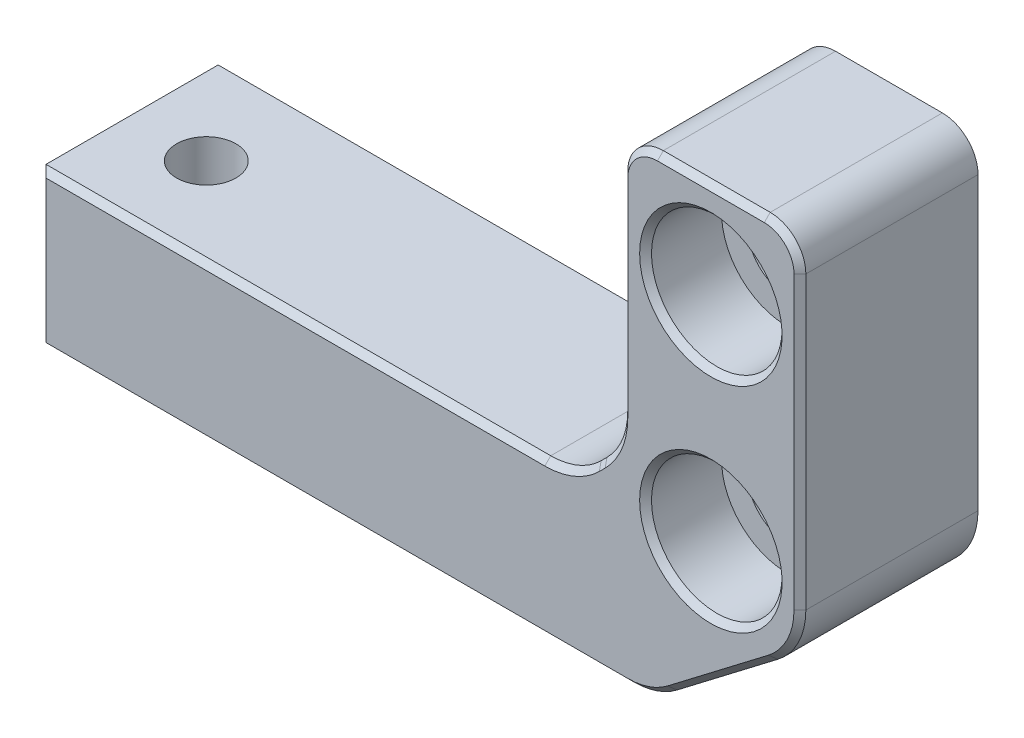
ISO-10303-21;
HEADER;
FILE_DESCRIPTION(('STEP AP214'),'2;1');
FILE_NAME('part.step','',(''),(''),'','','');
FILE_SCHEMA(('AUTOMOTIVE_DESIGN { 1 0 10303 214 1 1 1 1 }'));
ENDSEC;
DATA;
#1=APPLICATION_CONTEXT('core data for automotive mechanical design processes');
#2=APPLICATION_PROTOCOL_DEFINITION('international standard','automotive_design',2000,#1);
#3=PRODUCT_CONTEXT('',#1,'mechanical');
#4=PRODUCT('Part','Part','',(#3));
#5=PRODUCT_RELATED_PRODUCT_CATEGORY('part','',(#4));
#6=PRODUCT_DEFINITION_FORMATION('','',#4);
#7=PRODUCT_DEFINITION_CONTEXT('part definition',#1,'design');
#8=PRODUCT_DEFINITION('design','',#6,#7);
#9=PRODUCT_DEFINITION_SHAPE('','',#8);
#10=(LENGTH_UNIT() NAMED_UNIT(*) SI_UNIT(.MILLI.,.METRE.));
#11=(NAMED_UNIT(*) PLANE_ANGLE_UNIT() SI_UNIT($,.RADIAN.));
#12=(NAMED_UNIT(*) SI_UNIT($,.STERADIAN.) SOLID_ANGLE_UNIT());
#13=UNCERTAINTY_MEASURE_WITH_UNIT(LENGTH_MEASURE(1.E-05),#10,'distance_accuracy_value','');
#14=(GEOMETRIC_REPRESENTATION_CONTEXT(3) GLOBAL_UNCERTAINTY_ASSIGNED_CONTEXT((#13)) GLOBAL_UNIT_ASSIGNED_CONTEXT((#10,
#11,#12)) REPRESENTATION_CONTEXT('',''));
#15=CARTESIAN_POINT('',(0.,0.,0.));
#16=DIRECTION('',(0.,0.,1.));
#17=DIRECTION('',(1.,0.,0.));
#18=AXIS2_PLACEMENT_3D('',#15,#16,#17);
#19=CARTESIAN_POINT('',(19.014718625759,-13.832454105557,0.));
#20=DIRECTION('',(0.,0.,-1.));
#21=DIRECTION('',(-1.,0.,0.));
#22=AXIS2_PLACEMENT_3D('',#19,#20,#21);
#23=PLANE('',#22);
#24=DIRECTION('',(0.,-1.,0.));
#25=VECTOR('',#24,1.);
#26=CARTESIAN_POINT('',(-30.4999999999976,-6.83245410555701,0.));
#27=LINE('',#26,#25);
#28=CARTESIAN_POINT('',(-30.4999999999976,-6.83245410555701,0.));
#29=VERTEX_POINT('',#28);
#30=CARTESIAN_POINT('',(-30.4999999999976,-19.832454105557,0.));
#31=VERTEX_POINT('',#30);
#32=EDGE_CURVE('E191',#29,#31,#27,.T.);
#33=ORIENTED_EDGE('',*,*,#32,.F.);
#34=DIRECTION('',(-1.,0.,0.));
#35=VECTOR('',#34,1.);
#36=CARTESIAN_POINT('',(-30.4999999999976,-6.83245410555701,0.));
#37=LINE('',#36,#35);
#38=CARTESIAN_POINT('',(12.014718625759,-6.83245410555701,0.));
#39=VERTEX_POINT('',#38);
#40=EDGE_CURVE('E237',#39,#29,#37,.T.);
#41=ORIENTED_EDGE('',*,*,#40,.F.);
#42=CARTESIAN_POINT('',(12.014718625759,-0.832454105557007,0.));
#43=DIRECTION('',(0.,0.,-1.));
#44=DIRECTION('',(-1.,0.,0.));
#45=AXIS2_PLACEMENT_3D('',#42,#43,#44);
#46=CIRCLE('',#45,6.);
#47=CARTESIAN_POINT('',(16.2573593128783,-5.07509479267625,0.));
#48=VERTEX_POINT('',#47);
#49=EDGE_CURVE('E234',#48,#39,#46,.T.);
#50=ORIENTED_EDGE('',*,*,#49,.F.);
#51=DIRECTION('',(-0.707106781186538,-0.707106781186557,0.));
#52=VECTOR('',#51,1.);
#53=CARTESIAN_POINT('',(16.2573593128783,-5.07509479267625,0.));
#54=LINE('',#53,#52);
#55=CARTESIAN_POINT('',(16.7426406871169,-4.58981341843767,0.));
#56=VERTEX_POINT('',#55);
#57=EDGE_CURVE('E231',#56,#48,#54,.T.);
#58=ORIENTED_EDGE('',*,*,#57,.F.);
#59=CARTESIAN_POINT('',(12.4999999999976,-0.347172731318424,0.));
#60=DIRECTION('',(0.,0.,-1.));
#61=DIRECTION('',(1.,0.,0.));
#62=AXIS2_PLACEMENT_3D('',#59,#60,#61);
#63=CIRCLE('',#62,6.);
#64=CARTESIAN_POINT('',(18.4999999999976,-0.347172731318424,0.));
#65=VERTEX_POINT('',#64);
#66=EDGE_CURVE('E228',#65,#56,#63,.T.);
#67=ORIENTED_EDGE('',*,*,#66,.F.);
#68=DIRECTION('',(0.,-1.,0.));
#69=VECTOR('',#68,1.);
#70=CARTESIAN_POINT('',(18.4999999999976,-0.347172731318424,0.));
#71=LINE('',#70,#69);
#72=CARTESIAN_POINT('',(18.4999999999976,17.167545894443,0.));
#73=VERTEX_POINT('',#72);
#74=EDGE_CURVE('E225',#73,#65,#71,.T.);
#75=ORIENTED_EDGE('',*,*,#74,.F.);
#76=CARTESIAN_POINT('',(21.4999999999976,17.167545894443,0.));
#77=DIRECTION('',(0.,0.,1.));
#78=DIRECTION('',(1.,0.,0.));
#79=AXIS2_PLACEMENT_3D('',#76,#77,#78);
#80=CIRCLE('',#79,3.);
#81=CARTESIAN_POINT('',(21.4999999999976,20.167545894443,0.));
#82=VERTEX_POINT('',#81);
#83=EDGE_CURVE('E222',#82,#73,#80,.T.);
#84=ORIENTED_EDGE('',*,*,#83,.F.);
#85=DIRECTION('',(-1.,0.,0.));
#86=VECTOR('',#85,1.);
#87=CARTESIAN_POINT('',(30.4999999999976,20.167545894443,0.));
#88=LINE('',#87,#86);
#89=CARTESIAN_POINT('',(30.4999999999976,20.167545894443,0.));
#90=VERTEX_POINT('',#89);
#91=EDGE_CURVE('E219',#90,#82,#88,.T.);
#92=ORIENTED_EDGE('',*,*,#91,.F.);
#93=CARTESIAN_POINT('',(30.4999999999976,17.167545894443,0.));
#94=DIRECTION('',(0.,0.,1.));
#95=DIRECTION('',(1.,0.,0.));
#96=AXIS2_PLACEMENT_3D('',#93,#94,#95);
#97=CIRCLE('',#96,3.);
#98=CARTESIAN_POINT('',(33.4999999999976,17.167545894443,0.));
#99=VERTEX_POINT('',#98);
#100=EDGE_CURVE('E216',#99,#90,#97,.T.);
#101=ORIENTED_EDGE('',*,*,#100,.F.);
#102=DIRECTION('',(0.,1.,0.));
#103=VECTOR('',#102,1.);
#104=CARTESIAN_POINT('',(33.4999999999976,-7.34717273131841,0.));
#105=LINE('',#104,#103);
#106=CARTESIAN_POINT('',(33.4999999999976,-7.34717273131841,0.));
#107=VERTEX_POINT('',#106);
#108=EDGE_CURVE('E213',#107,#99,#105,.T.);
#109=ORIENTED_EDGE('',*,*,#108,.F.);
#110=CARTESIAN_POINT('',(27.4999999999976,-7.34717273131841,0.));
#111=DIRECTION('',(0.,0.,1.));
#112=DIRECTION('',(1.,0.,0.));
#113=AXIS2_PLACEMENT_3D('',#110,#111,#112);
#114=CIRCLE('',#113,6.);
#115=CARTESIAN_POINT('',(31.1434728099418,-12.1142584116054,0.));
#116=VERTEX_POINT('',#115);
#117=EDGE_CURVE('E210',#116,#107,#114,.T.);
#118=ORIENTED_EDGE('',*,*,#117,.F.);
#119=DIRECTION('',(0.794514280047827,0.60724546832404,0.));
#120=VECTOR('',#119,1.);
#121=CARTESIAN_POINT('',(22.6581914357032,-18.599539785844,0.));
#122=LINE('',#121,#120);
#123=CARTESIAN_POINT('',(22.6581914357032,-18.599539785844,0.));
#124=VERTEX_POINT('',#123);
#125=EDGE_CURVE('E207',#124,#116,#122,.T.);
#126=ORIENTED_EDGE('',*,*,#125,.F.);
#127=CARTESIAN_POINT('',(19.014718625759,-13.832454105557,0.));
#128=DIRECTION('',(0.,0.,1.));
#129=DIRECTION('',(-1.,0.,0.));
#130=AXIS2_PLACEMENT_3D('',#127,#128,#129);
#131=CIRCLE('',#130,6.00000000000001);
#132=CARTESIAN_POINT('',(19.014718625759,-19.832454105557,0.));
#133=VERTEX_POINT('',#132);
#134=EDGE_CURVE('E194',#133,#124,#131,.T.);
#135=ORIENTED_EDGE('',*,*,#134,.F.);
#136=DIRECTION('',(1.,0.,0.));
#137=VECTOR('',#136,1.);
#138=CARTESIAN_POINT('',(-30.4999999999976,-19.832454105557,0.));
#139=LINE('',#138,#137);
#140=EDGE_CURVE('E179',#31,#133,#139,.T.);
#141=ORIENTED_EDGE('',*,*,#140,.F.);
#142=EDGE_LOOP('',(#33,#41,#50,#58,#67,#75,#84,#92,#101,#109,#118,#126,#135,#141));
#143=FACE_BOUND('',#142,.T.);
#144=CARTESIAN_POINT('',(25.9999999999976,-5.83245410555701,0.));
#145=DIRECTION('',(0.,0.,1.));
#146=DIRECTION('',(1.,0.,0.));
#147=AXIS2_PLACEMENT_3D('',#144,#145,#146);
#148=CIRCLE('',#147,3.3);
#149=CARTESIAN_POINT('',(29.2999999999976,-5.83245410555701,0.));
#150=VERTEX_POINT('',#149);
#151=EDGE_CURVE('E199',#150,#150,#148,.T.);
#152=ORIENTED_EDGE('',*,*,#151,.T.);
#153=EDGE_LOOP('',(#152));
#154=FACE_BOUND('',#153,.T.);
#155=CARTESIAN_POINT('',(25.9999999999976,12.167545894443,0.));
#156=DIRECTION('',(0.,0.,1.));
#157=DIRECTION('',(1.,0.,0.));
#158=AXIS2_PLACEMENT_3D('',#155,#156,#157);
#159=CIRCLE('',#158,3.3);
#160=CARTESIAN_POINT('',(29.2999999999976,12.167545894443,0.));
#161=VERTEX_POINT('',#160);
#162=EDGE_CURVE('E386',#161,#161,#159,.T.);
#163=ORIENTED_EDGE('',*,*,#162,.T.);
#164=EDGE_LOOP('',(#163));
#165=FACE_BOUND('',#164,.T.);
#166=ADVANCED_FACE('F32',(#143,#154,#165),#23,.T.);
#167=CARTESIAN_POINT('',(19.014718625759,-13.832454105557,15.));
#168=DIRECTION('',(0.,0.,-1.));
#169=DIRECTION('',(-1.,0.,0.));
#170=AXIS2_PLACEMENT_3D('',#167,#168,#169);
#171=PLANE('',#170);
#172=CARTESIAN_POINT('',(25.9999999999976,12.167545894443,15.));
#173=DIRECTION('',(0.,0.,-1.));
#174=DIRECTION('',(-1.,0.,0.));
#175=AXIS2_PLACEMENT_3D('',#172,#173,#174);
#176=CIRCLE('',#175,6.);
#177=CARTESIAN_POINT('',(19.9999999999976,12.167545894443,15.));
#178=VERTEX_POINT('',#177);
#179=EDGE_CURVE('E297',#178,#178,#176,.T.);
#180=ORIENTED_EDGE('',*,*,#179,.T.);
#181=EDGE_LOOP('',(#180));
#182=FACE_BOUND('',#181,.T.);
#183=CARTESIAN_POINT('',(25.9999999999976,-5.83245410555701,15.));
#184=DIRECTION('',(0.,0.,-1.));
#185=DIRECTION('',(-1.,0.,0.));
#186=AXIS2_PLACEMENT_3D('',#183,#184,#185);
#187=CIRCLE('',#186,5.99999999999999);
#188=CARTESIAN_POINT('',(19.9999999999976,-5.83245410555701,15.));
#189=VERTEX_POINT('',#188);
#190=EDGE_CURVE('E294',#189,#189,#187,.T.);
#191=ORIENTED_EDGE('',*,*,#190,.T.);
#192=EDGE_LOOP('',(#191));
#193=FACE_BOUND('',#192,.T.);
#194=DIRECTION('',(0.,-1.,0.));
#195=VECTOR('',#194,1.);
#196=CARTESIAN_POINT('',(-29.9999999999976,-13.832454105557,15.));
#197=LINE('',#196,#195);
#198=CARTESIAN_POINT('',(-29.9999999999976,-7.33245410555701,15.));
#199=VERTEX_POINT('',#198);
#200=CARTESIAN_POINT('',(-29.9999999999976,-19.332454105557,15.));
#201=VERTEX_POINT('',#200);
#202=EDGE_CURVE('E267',#199,#201,#197,.T.);
#203=ORIENTED_EDGE('',*,*,#202,.T.);
#204=DIRECTION('',(1.,0.,0.));
#205=VECTOR('',#204,1.);
#206=CARTESIAN_POINT('',(19.014718625759,-19.332454105557,15.));
#207=LINE('',#206,#205);
#208=CARTESIAN_POINT('',(19.014718625759,-19.332454105557,15.));
#209=VERTEX_POINT('',#208);
#210=EDGE_CURVE('E291',#201,#209,#207,.T.);
#211=ORIENTED_EDGE('',*,*,#210,.T.);
#212=CARTESIAN_POINT('',(19.014718625759,-13.832454105557,15.));
#213=DIRECTION('',(0.,0.,-1.));
#214=DIRECTION('',(-1.,0.,0.));
#215=AXIS2_PLACEMENT_3D('',#212,#213,#214);
#216=CIRCLE('',#215,5.50000000000001);
#217=CARTESIAN_POINT('',(22.3545687015412,-18.2022826458201,15.));
#218=VERTEX_POINT('',#217);
#219=EDGE_CURVE('E289',#209,#218,#216,.F.);
#220=ORIENTED_EDGE('',*,*,#219,.T.);
#221=DIRECTION('',(0.794514280047827,0.60724546832404,0.));
#222=VECTOR('',#221,1.);
#223=CARTESIAN_POINT('',(22.3545687015412,-18.2022826458201,15.));
#224=LINE('',#223,#222);
#225=CARTESIAN_POINT('',(30.8398500757798,-11.7170012715815,15.));
#226=VERTEX_POINT('',#225);
#227=EDGE_CURVE('E287',#218,#226,#224,.T.);
#228=ORIENTED_EDGE('',*,*,#227,.T.);
#229=CARTESIAN_POINT('',(27.4999999999976,-7.34717273131841,15.));
#230=DIRECTION('',(0.,0.,-1.));
#231=DIRECTION('',(-1.,0.,0.));
#232=AXIS2_PLACEMENT_3D('',#229,#230,#231);
#233=CIRCLE('',#232,5.5);
#234=CARTESIAN_POINT('',(32.9999999999976,-7.34717273131841,15.));
#235=VERTEX_POINT('',#234);
#236=EDGE_CURVE('E285',#226,#235,#233,.F.);
#237=ORIENTED_EDGE('',*,*,#236,.T.);
#238=DIRECTION('',(0.,1.,0.));
#239=VECTOR('',#238,1.);
#240=CARTESIAN_POINT('',(32.9999999999976,-13.832454105557,15.));
#241=LINE('',#240,#239);
#242=CARTESIAN_POINT('',(32.9999999999976,17.167545894443,15.));
#243=VERTEX_POINT('',#242);
#244=EDGE_CURVE('E283',#235,#243,#241,.T.);
#245=ORIENTED_EDGE('',*,*,#244,.T.);
#246=CARTESIAN_POINT('',(30.4999999999976,17.167545894443,15.));
#247=DIRECTION('',(0.,0.,-1.));
#248=DIRECTION('',(-1.,0.,0.));
#249=AXIS2_PLACEMENT_3D('',#246,#247,#248);
#250=CIRCLE('',#249,2.5);
#251=CARTESIAN_POINT('',(30.4999999999976,19.667545894443,15.));
#252=VERTEX_POINT('',#251);
#253=EDGE_CURVE('E281',#243,#252,#250,.F.);
#254=ORIENTED_EDGE('',*,*,#253,.T.);
#255=DIRECTION('',(-1.,0.,0.));
#256=VECTOR('',#255,1.);
#257=CARTESIAN_POINT('',(19.014718625759,19.667545894443,15.));
#258=LINE('',#257,#256);
#259=CARTESIAN_POINT('',(21.4999999999976,19.667545894443,15.));
#260=VERTEX_POINT('',#259);
#261=EDGE_CURVE('E279',#252,#260,#258,.T.);
#262=ORIENTED_EDGE('',*,*,#261,.T.);
#263=CARTESIAN_POINT('',(21.4999999999976,17.167545894443,15.));
#264=DIRECTION('',(0.,0.,-1.));
#265=DIRECTION('',(-1.,0.,0.));
#266=AXIS2_PLACEMENT_3D('',#263,#264,#265);
#267=CIRCLE('',#266,2.5);
#268=CARTESIAN_POINT('',(18.9999999999976,17.167545894443,15.));
#269=VERTEX_POINT('',#268);
#270=EDGE_CURVE('E277',#260,#269,#267,.F.);
#271=ORIENTED_EDGE('',*,*,#270,.T.);
#272=DIRECTION('',(0.,-1.,0.));
#273=VECTOR('',#272,1.);
#274=CARTESIAN_POINT('',(18.9999999999976,-13.832454105557,15.));
#275=LINE('',#274,#273);
#276=CARTESIAN_POINT('',(18.9999999999976,-0.347172731318424,15.));
#277=VERTEX_POINT('',#276);
#278=EDGE_CURVE('E275',#269,#277,#275,.T.);
#279=ORIENTED_EDGE('',*,*,#278,.T.);
#280=CARTESIAN_POINT('',(12.4999999999976,-0.347172731318424,15.));
#281=DIRECTION('',(0.,0.,-1.));
#282=DIRECTION('',(-1.,0.,0.));
#283=AXIS2_PLACEMENT_3D('',#280,#281,#282);
#284=CIRCLE('',#283,6.5);
#285=CARTESIAN_POINT('',(17.0961940777102,-4.94336680903094,15.));
#286=VERTEX_POINT('',#285);
#287=EDGE_CURVE('E273',#277,#286,#284,.T.);
#288=ORIENTED_EDGE('',*,*,#287,.T.);
#289=DIRECTION('',(-0.707106781186538,-0.707106781186557,0.));
#290=VECTOR('',#289,1.);
#291=CARTESIAN_POINT('',(13.6109127034715,-8.42864818326968,15.));
#292=LINE('',#291,#290);
#293=CARTESIAN_POINT('',(16.6109127034716,-5.42864818326952,15.));
#294=VERTEX_POINT('',#293);
#295=EDGE_CURVE('E271',#286,#294,#292,.T.);
#296=ORIENTED_EDGE('',*,*,#295,.T.);
#297=CARTESIAN_POINT('',(12.014718625759,-0.832454105557007,15.));
#298=DIRECTION('',(0.,0.,-1.));
#299=DIRECTION('',(-1.,0.,0.));
#300=AXIS2_PLACEMENT_3D('',#297,#298,#299);
#301=CIRCLE('',#300,6.5);
#302=CARTESIAN_POINT('',(12.014718625759,-7.33245410555701,15.));
#303=VERTEX_POINT('',#302);
#304=EDGE_CURVE('E269',#294,#303,#301,.T.);
#305=ORIENTED_EDGE('',*,*,#304,.T.);
#306=DIRECTION('',(-1.,0.,0.));
#307=VECTOR('',#306,1.);
#308=CARTESIAN_POINT('',(19.014718625759,-7.33245410555701,15.));
#309=LINE('',#308,#307);
#310=EDGE_CURVE('E265',#303,#199,#309,.T.);
#311=ORIENTED_EDGE('',*,*,#310,.T.);
#312=EDGE_LOOP('',(#203,#211,#220,#228,#237,#245,#254,#262,#271,#279,#288,#296,#305,#311));
#313=FACE_BOUND('',#312,.T.);
#314=ADVANCED_FACE('F414',(#182,#193,#313),#171,.F.);
#315=CARTESIAN_POINT('',(-30.4999999999976,-6.83245410555701,15.));
#316=DIRECTION('',(1.,0.,0.));
#317=DIRECTION('',(0.,0.,-1.));
#318=AXIS2_PLACEMENT_3D('',#315,#316,#317);
#319=PLANE('',#318);
#320=DIRECTION('',(0.,0.,-1.));
#321=VECTOR('',#320,1.);
#322=CARTESIAN_POINT('',(-30.4999999999976,-19.832454105557,15.));
#323=LINE('',#322,#321);
#324=CARTESIAN_POINT('',(-30.4999999999976,-19.832454105557,14.5));
#325=VERTEX_POINT('',#324);
#326=EDGE_CURVE('E175',#325,#31,#323,.T.);
#327=ORIENTED_EDGE('',*,*,#326,.F.);
#328=DIRECTION('',(0.,1.,0.));
#329=VECTOR('',#328,1.);
#330=CARTESIAN_POINT('',(-30.4999999999976,-6.83245410555701,14.5));
#331=LINE('',#330,#329);
#332=CARTESIAN_POINT('',(-30.4999999999976,-6.83245410555701,14.5));
#333=VERTEX_POINT('',#332);
#334=EDGE_CURVE('E41',#325,#333,#331,.T.);
#335=ORIENTED_EDGE('',*,*,#334,.T.);
#336=DIRECTION('',(0.,0.,-1.));
#337=VECTOR('',#336,1.);
#338=CARTESIAN_POINT('',(-30.4999999999976,-6.83245410555701,15.));
#339=LINE('',#338,#337);
#340=EDGE_CURVE('E197',#333,#29,#339,.T.);
#341=ORIENTED_EDGE('',*,*,#340,.T.);
#342=ORIENTED_EDGE('',*,*,#32,.T.);
#343=EDGE_LOOP('',(#327,#335,#341,#342));
#344=FACE_BOUND('',#343,.T.);
#345=ADVANCED_FACE('F196',(#344),#319,.F.);
#346=CARTESIAN_POINT('',(-30.4999999999976,-19.832454105557,15.));
#347=DIRECTION('',(0.,1.,0.));
#348=DIRECTION('',(0.,0.,1.));
#349=AXIS2_PLACEMENT_3D('',#346,#347,#348);
#350=PLANE('',#349);
#351=CARTESIAN_POINT('',(-23.9999999999976,-19.832454105557,7.5));
#352=DIRECTION('',(0.,1.,0.));
#353=DIRECTION('',(0.,0.,1.));
#354=AXIS2_PLACEMENT_3D('',#351,#352,#353);
#355=CIRCLE('',#354,2.5);
#356=CARTESIAN_POINT('',(-23.9999999999976,-19.832454105557,10.));
#357=VERTEX_POINT('',#356);
#358=EDGE_CURVE('E373',#357,#357,#355,.T.);
#359=ORIENTED_EDGE('',*,*,#358,.T.);
#360=EDGE_LOOP('',(#359));
#361=FACE_BOUND('',#360,.T.);
#362=DIRECTION('',(0.,0.,-1.));
#363=VECTOR('',#362,1.);
#364=CARTESIAN_POINT('',(19.014718625759,-19.832454105557,15.));
#365=LINE('',#364,#363);
#366=CARTESIAN_POINT('',(19.014718625759,-19.832454105557,14.5));
#367=VERTEX_POINT('',#366);
#368=EDGE_CURVE('E185',#367,#133,#365,.T.);
#369=ORIENTED_EDGE('',*,*,#368,.F.);
#370=DIRECTION('',(-1.,0.,0.));
#371=VECTOR('',#370,1.);
#372=CARTESIAN_POINT('',(-30.4999999999976,-19.832454105557,14.5));
#373=LINE('',#372,#371);
#374=EDGE_CURVE('E182',#367,#325,#373,.T.);
#375=ORIENTED_EDGE('',*,*,#374,.T.);
#376=ORIENTED_EDGE('',*,*,#326,.T.);
#377=ORIENTED_EDGE('',*,*,#140,.T.);
#378=EDGE_LOOP('',(#369,#375,#376,#377));
#379=FACE_BOUND('',#378,.T.);
#380=ADVANCED_FACE('F178',(#361,#379),#350,.F.);
#381=CARTESIAN_POINT('',(19.014718625759,-13.832454105557,15.));
#382=DIRECTION('',(0.,0.,-1.));
#383=DIRECTION('',(-1.,0.,0.));
#384=AXIS2_PLACEMENT_3D('',#381,#382,#383);
#385=CYLINDRICAL_SURFACE('',#384,6.00000000000001);
#386=DIRECTION('',(0.,0.,-1.));
#387=VECTOR('',#386,1.);
#388=CARTESIAN_POINT('',(22.6581914357032,-18.599539785844,15.));
#389=LINE('',#388,#387);
#390=CARTESIAN_POINT('',(22.6581914357032,-18.599539785844,14.5));
#391=VERTEX_POINT('',#390);
#392=EDGE_CURVE('E260',#391,#124,#389,.T.);
#393=ORIENTED_EDGE('',*,*,#392,.F.);
#394=CARTESIAN_POINT('',(19.014718625759,-13.832454105557,14.5));
#395=DIRECTION('',(0.,0.,-1.));
#396=DIRECTION('',(-1.,0.,0.));
#397=AXIS2_PLACEMENT_3D('',#394,#395,#396);
#398=CIRCLE('',#397,6.00000000000001);
#399=EDGE_CURVE('E304',#391,#367,#398,.T.);
#400=ORIENTED_EDGE('',*,*,#399,.T.);
#401=ORIENTED_EDGE('',*,*,#368,.T.);
#402=ORIENTED_EDGE('',*,*,#134,.T.);
#403=EDGE_LOOP('',(#393,#400,#401,#402));
#404=FACE_BOUND('',#403,.T.);
#405=ADVANCED_FACE('F466',(#404),#385,.T.);
#406=CARTESIAN_POINT('',(22.6581914357032,-18.599539785844,15.));
#407=DIRECTION('',(-0.60724546832404,0.794514280047827,0.));
#408=DIRECTION('',(-0.794514280047828,-0.60724546832404,0.));
#409=AXIS2_PLACEMENT_3D('',#406,#407,#408);
#410=PLANE('',#409);
#411=DIRECTION('',(0.,0.,-1.));
#412=VECTOR('',#411,1.);
#413=CARTESIAN_POINT('',(31.1434728099418,-12.1142584116054,15.));
#414=LINE('',#413,#412);
#415=CARTESIAN_POINT('',(31.1434728099418,-12.1142584116054,14.5));
#416=VERTEX_POINT('',#415);
#417=EDGE_CURVE('E258',#416,#116,#414,.T.);
#418=ORIENTED_EDGE('',*,*,#417,.F.);
#419=DIRECTION('',(-0.794514280047828,-0.60724546832404,0.));
#420=VECTOR('',#419,1.);
#421=CARTESIAN_POINT('',(22.6581914357032,-18.599539785844,14.5));
#422=LINE('',#421,#420);
#423=EDGE_CURVE('E306',#416,#391,#422,.T.);
#424=ORIENTED_EDGE('',*,*,#423,.T.);
#425=ORIENTED_EDGE('',*,*,#392,.T.);
#426=ORIENTED_EDGE('',*,*,#125,.T.);
#427=EDGE_LOOP('',(#418,#424,#425,#426));
#428=FACE_BOUND('',#427,.T.);
#429=ADVANCED_FACE('F462',(#428),#410,.F.);
#430=CARTESIAN_POINT('',(27.4999999999976,-7.34717273131841,15.));
#431=DIRECTION('',(0.,0.,-1.));
#432=DIRECTION('',(-1.,0.,0.));
#433=AXIS2_PLACEMENT_3D('',#430,#431,#432);
#434=CYLINDRICAL_SURFACE('',#433,6.);
#435=DIRECTION('',(0.,0.,-1.));
#436=VECTOR('',#435,1.);
#437=CARTESIAN_POINT('',(33.4999999999976,-7.34717273131841,15.));
#438=LINE('',#437,#436);
#439=CARTESIAN_POINT('',(33.4999999999976,-7.34717273131841,14.5));
#440=VERTEX_POINT('',#439);
#441=EDGE_CURVE('E256',#440,#107,#438,.T.);
#442=ORIENTED_EDGE('',*,*,#441,.F.);
#443=CARTESIAN_POINT('',(27.4999999999976,-7.34717273131841,14.5));
#444=DIRECTION('',(0.,0.,-1.));
#445=DIRECTION('',(-1.,0.,0.));
#446=AXIS2_PLACEMENT_3D('',#443,#444,#445);
#447=CIRCLE('',#446,6.);
#448=EDGE_CURVE('E308',#440,#416,#447,.T.);
#449=ORIENTED_EDGE('',*,*,#448,.T.);
#450=ORIENTED_EDGE('',*,*,#417,.T.);
#451=ORIENTED_EDGE('',*,*,#117,.T.);
#452=EDGE_LOOP('',(#442,#449,#450,#451));
#453=FACE_BOUND('',#452,.T.);
#454=ADVANCED_FACE('F458',(#453),#434,.T.);
#455=CARTESIAN_POINT('',(33.4999999999976,-7.34717273131841,15.));
#456=DIRECTION('',(-1.,0.,0.));
#457=DIRECTION('',(0.,0.,1.));
#458=AXIS2_PLACEMENT_3D('',#455,#456,#457);
#459=PLANE('',#458);
#460=DIRECTION('',(0.,0.,-1.));
#461=VECTOR('',#460,1.);
#462=CARTESIAN_POINT('',(33.4999999999976,17.167545894443,15.));
#463=LINE('',#462,#461);
#464=CARTESIAN_POINT('',(33.4999999999976,17.167545894443,14.5));
#465=VERTEX_POINT('',#464);
#466=EDGE_CURVE('E254',#465,#99,#463,.T.);
#467=ORIENTED_EDGE('',*,*,#466,.F.);
#468=DIRECTION('',(0.,-1.,0.));
#469=VECTOR('',#468,1.);
#470=CARTESIAN_POINT('',(33.4999999999976,-7.34717273131841,14.5));
#471=LINE('',#470,#469);
#472=EDGE_CURVE('E310',#465,#440,#471,.T.);
#473=ORIENTED_EDGE('',*,*,#472,.T.);
#474=ORIENTED_EDGE('',*,*,#441,.T.);
#475=ORIENTED_EDGE('',*,*,#108,.T.);
#476=EDGE_LOOP('',(#467,#473,#474,#475));
#477=FACE_BOUND('',#476,.T.);
#478=ADVANCED_FACE('F454',(#477),#459,.F.);
#479=CARTESIAN_POINT('',(30.4999999999976,17.167545894443,15.));
#480=DIRECTION('',(0.,0.,-1.));
#481=DIRECTION('',(-1.,0.,0.));
#482=AXIS2_PLACEMENT_3D('',#479,#480,#481);
#483=CYLINDRICAL_SURFACE('',#482,3.);
#484=DIRECTION('',(0.,0.,-1.));
#485=VECTOR('',#484,1.);
#486=CARTESIAN_POINT('',(30.4999999999976,20.167545894443,15.));
#487=LINE('',#486,#485);
#488=CARTESIAN_POINT('',(30.4999999999976,20.167545894443,14.5));
#489=VERTEX_POINT('',#488);
#490=EDGE_CURVE('E252',#489,#90,#487,.T.);
#491=ORIENTED_EDGE('',*,*,#490,.F.);
#492=CARTESIAN_POINT('',(30.4999999999976,17.167545894443,14.5));
#493=DIRECTION('',(0.,0.,-1.));
#494=DIRECTION('',(-1.,0.,0.));
#495=AXIS2_PLACEMENT_3D('',#492,#493,#494);
#496=CIRCLE('',#495,3.);
#497=EDGE_CURVE('E312',#489,#465,#496,.T.);
#498=ORIENTED_EDGE('',*,*,#497,.T.);
#499=ORIENTED_EDGE('',*,*,#466,.T.);
#500=ORIENTED_EDGE('',*,*,#100,.T.);
#501=EDGE_LOOP('',(#491,#498,#499,#500));
#502=FACE_BOUND('',#501,.T.);
#503=ADVANCED_FACE('F450',(#502),#483,.T.);
#504=CARTESIAN_POINT('',(30.4999999999976,20.167545894443,15.));
#505=DIRECTION('',(0.,-1.,0.));
#506=DIRECTION('',(0.,0.,-1.));
#507=AXIS2_PLACEMENT_3D('',#504,#505,#506);
#508=PLANE('',#507);
#509=DIRECTION('',(0.,0.,-1.));
#510=VECTOR('',#509,1.);
#511=CARTESIAN_POINT('',(21.4999999999976,20.167545894443,15.));
#512=LINE('',#511,#510);
#513=CARTESIAN_POINT('',(21.4999999999976,20.167545894443,14.5));
#514=VERTEX_POINT('',#513);
#515=EDGE_CURVE('E250',#514,#82,#512,.T.);
#516=ORIENTED_EDGE('',*,*,#515,.F.);
#517=DIRECTION('',(1.,0.,0.));
#518=VECTOR('',#517,1.);
#519=CARTESIAN_POINT('',(30.4999999999976,20.167545894443,14.5));
#520=LINE('',#519,#518);
#521=EDGE_CURVE('E314',#514,#489,#520,.T.);
#522=ORIENTED_EDGE('',*,*,#521,.T.);
#523=ORIENTED_EDGE('',*,*,#490,.T.);
#524=ORIENTED_EDGE('',*,*,#91,.T.);
#525=EDGE_LOOP('',(#516,#522,#523,#524));
#526=FACE_BOUND('',#525,.T.);
#527=ADVANCED_FACE('F446',(#526),#508,.F.);
#528=CARTESIAN_POINT('',(21.4999999999976,17.167545894443,15.));
#529=DIRECTION('',(0.,0.,-1.));
#530=DIRECTION('',(-1.,0.,0.));
#531=AXIS2_PLACEMENT_3D('',#528,#529,#530);
#532=CYLINDRICAL_SURFACE('',#531,3.);
#533=DIRECTION('',(0.,0.,-1.));
#534=VECTOR('',#533,1.);
#535=CARTESIAN_POINT('',(18.4999999999976,17.167545894443,15.));
#536=LINE('',#535,#534);
#537=CARTESIAN_POINT('',(18.4999999999976,17.167545894443,14.5));
#538=VERTEX_POINT('',#537);
#539=EDGE_CURVE('E248',#538,#73,#536,.T.);
#540=ORIENTED_EDGE('',*,*,#539,.F.);
#541=CARTESIAN_POINT('',(21.4999999999976,17.167545894443,14.5));
#542=DIRECTION('',(0.,0.,-1.));
#543=DIRECTION('',(-1.,0.,0.));
#544=AXIS2_PLACEMENT_3D('',#541,#542,#543);
#545=CIRCLE('',#544,3.);
#546=EDGE_CURVE('E316',#538,#514,#545,.T.);
#547=ORIENTED_EDGE('',*,*,#546,.T.);
#548=ORIENTED_EDGE('',*,*,#515,.T.);
#549=ORIENTED_EDGE('',*,*,#83,.T.);
#550=EDGE_LOOP('',(#540,#547,#548,#549));
#551=FACE_BOUND('',#550,.T.);
#552=ADVANCED_FACE('F442',(#551),#532,.T.);
#553=CARTESIAN_POINT('',(18.4999999999976,-0.347172731318424,15.));
#554=DIRECTION('',(1.,0.,0.));
#555=DIRECTION('',(0.,1.,0.));
#556=AXIS2_PLACEMENT_3D('',#553,#554,#555);
#557=PLANE('',#556);
#558=DIRECTION('',(0.,0.,-1.));
#559=VECTOR('',#558,1.);
#560=CARTESIAN_POINT('',(18.4999999999976,-0.347172731318424,15.));
#561=LINE('',#560,#559);
#562=CARTESIAN_POINT('',(18.4999999999976,-0.347172731318424,14.5));
#563=VERTEX_POINT('',#562);
#564=EDGE_CURVE('E246',#563,#65,#561,.T.);
#565=ORIENTED_EDGE('',*,*,#564,.F.);
#566=DIRECTION('',(0.,1.,0.));
#567=VECTOR('',#566,1.);
#568=CARTESIAN_POINT('',(18.4999999999976,-0.347172731318424,14.5));
#569=LINE('',#568,#567);
#570=EDGE_CURVE('E318',#563,#538,#569,.T.);
#571=ORIENTED_EDGE('',*,*,#570,.T.);
#572=ORIENTED_EDGE('',*,*,#539,.T.);
#573=ORIENTED_EDGE('',*,*,#74,.T.);
#574=EDGE_LOOP('',(#565,#571,#572,#573));
#575=FACE_BOUND('',#574,.T.);
#576=ADVANCED_FACE('F438',(#575),#557,.F.);
#577=CARTESIAN_POINT('',(12.4999999999976,-0.347172731318424,15.));
#578=DIRECTION('',(0.,0.,-1.));
#579=DIRECTION('',(-1.,0.,0.));
#580=AXIS2_PLACEMENT_3D('',#577,#578,#579);
#581=CYLINDRICAL_SURFACE('',#580,6.);
#582=DIRECTION('',(0.,0.,-1.));
#583=VECTOR('',#582,1.);
#584=CARTESIAN_POINT('',(16.7426406871169,-4.58981341843767,15.));
#585=LINE('',#584,#583);
#586=CARTESIAN_POINT('',(16.7426406871169,-4.58981341843767,14.5));
#587=VERTEX_POINT('',#586);
#588=EDGE_CURVE('E244',#587,#56,#585,.T.);
#589=ORIENTED_EDGE('',*,*,#588,.F.);
#590=CARTESIAN_POINT('',(12.4999999999976,-0.347172731318424,14.5));
#591=DIRECTION('',(0.,0.,-1.));
#592=DIRECTION('',(-1.,0.,0.));
#593=AXIS2_PLACEMENT_3D('',#590,#591,#592);
#594=CIRCLE('',#593,6.);
#595=EDGE_CURVE('E320',#587,#563,#594,.F.);
#596=ORIENTED_EDGE('',*,*,#595,.T.);
#597=ORIENTED_EDGE('',*,*,#564,.T.);
#598=ORIENTED_EDGE('',*,*,#66,.T.);
#599=EDGE_LOOP('',(#589,#596,#597,#598));
#600=FACE_BOUND('',#599,.T.);
#601=ADVANCED_FACE('F434',(#600),#581,.F.);
#602=CARTESIAN_POINT('',(16.2573593128783,-5.07509479267625,15.));
#603=DIRECTION('',(0.707106781186557,-0.707106781186538,0.));
#604=DIRECTION('',(0.707106781186538,0.707106781186557,0.));
#605=AXIS2_PLACEMENT_3D('',#602,#603,#604);
#606=PLANE('',#605);
#607=DIRECTION('',(0.,0.,-1.));
#608=VECTOR('',#607,1.);
#609=CARTESIAN_POINT('',(16.2573593128783,-5.07509479267625,15.));
#610=LINE('',#609,#608);
#611=CARTESIAN_POINT('',(16.2573593128783,-5.07509479267625,14.5));
#612=VERTEX_POINT('',#611);
#613=EDGE_CURVE('E242',#612,#48,#610,.T.);
#614=ORIENTED_EDGE('',*,*,#613,.F.);
#615=DIRECTION('',(0.707106781186538,0.707106781186557,0.));
#616=VECTOR('',#615,1.);
#617=CARTESIAN_POINT('',(16.2573593128783,-5.07509479267625,14.5));
#618=LINE('',#617,#616);
#619=EDGE_CURVE('E322',#612,#587,#618,.T.);
#620=ORIENTED_EDGE('',*,*,#619,.T.);
#621=ORIENTED_EDGE('',*,*,#588,.T.);
#622=ORIENTED_EDGE('',*,*,#57,.T.);
#623=EDGE_LOOP('',(#614,#620,#621,#622));
#624=FACE_BOUND('',#623,.T.);
#625=ADVANCED_FACE('F430',(#624),#606,.F.);
#626=CARTESIAN_POINT('',(12.014718625759,-0.832454105557007,15.));
#627=DIRECTION('',(0.,0.,-1.));
#628=DIRECTION('',(-1.,0.,0.));
#629=AXIS2_PLACEMENT_3D('',#626,#627,#628);
#630=CYLINDRICAL_SURFACE('',#629,6.);
#631=DIRECTION('',(0.,0.,-1.));
#632=VECTOR('',#631,1.);
#633=CARTESIAN_POINT('',(12.014718625759,-6.83245410555701,15.));
#634=LINE('',#633,#632);
#635=CARTESIAN_POINT('',(12.014718625759,-6.83245410555701,14.5));
#636=VERTEX_POINT('',#635);
#637=EDGE_CURVE('E240',#636,#39,#634,.T.);
#638=ORIENTED_EDGE('',*,*,#637,.F.);
#639=CARTESIAN_POINT('',(12.014718625759,-0.832454105557007,14.5));
#640=DIRECTION('',(0.,0.,-1.));
#641=DIRECTION('',(-1.,0.,0.));
#642=AXIS2_PLACEMENT_3D('',#639,#640,#641);
#643=CIRCLE('',#642,6.);
#644=EDGE_CURVE('E324',#636,#612,#643,.F.);
#645=ORIENTED_EDGE('',*,*,#644,.T.);
#646=ORIENTED_EDGE('',*,*,#613,.T.);
#647=ORIENTED_EDGE('',*,*,#49,.T.);
#648=EDGE_LOOP('',(#638,#645,#646,#647));
#649=FACE_BOUND('',#648,.T.);
#650=ADVANCED_FACE('F426',(#649),#630,.F.);
#651=CARTESIAN_POINT('',(-30.4999999999976,-6.83245410555701,15.));
#652=DIRECTION('',(0.,-1.,0.));
#653=DIRECTION('',(0.,0.,-1.));
#654=AXIS2_PLACEMENT_3D('',#651,#652,#653);
#655=PLANE('',#654);
#656=CARTESIAN_POINT('',(-23.9999999999976,-6.83245410555701,7.5));
#657=DIRECTION('',(0.,1.,0.));
#658=DIRECTION('',(0.,0.,1.));
#659=AXIS2_PLACEMENT_3D('',#656,#657,#658);
#660=CIRCLE('',#659,2.5);
#661=CARTESIAN_POINT('',(-23.9999999999976,-6.83245410555701,10.));
#662=VERTEX_POINT('',#661);
#663=EDGE_CURVE('E367',#662,#662,#660,.T.);
#664=ORIENTED_EDGE('',*,*,#663,.F.);
#665=EDGE_LOOP('',(#664));
#666=FACE_BOUND('',#665,.T.);
#667=ORIENTED_EDGE('',*,*,#340,.F.);
#668=DIRECTION('',(1.,0.,0.));
#669=VECTOR('',#668,1.);
#670=CARTESIAN_POINT('',(-30.4999999999976,-6.83245410555701,14.5));
#671=LINE('',#670,#669);
#672=EDGE_CURVE('E11',#333,#636,#671,.T.);
#673=ORIENTED_EDGE('',*,*,#672,.T.);
#674=ORIENTED_EDGE('',*,*,#637,.T.);
#675=ORIENTED_EDGE('',*,*,#40,.T.);
#676=EDGE_LOOP('',(#667,#673,#674,#675));
#677=FACE_BOUND('',#676,.T.);
#678=ADVANCED_FACE('F423',(#666,#677),#655,.F.);
#679=CARTESIAN_POINT('',(25.9999999999976,-5.83245410555701,15.));
#680=DIRECTION('',(0.,0.,1.));
#681=DIRECTION('',(1.,0.,0.));
#682=AXIS2_PLACEMENT_3D('',#679,#680,#681);
#683=CYLINDRICAL_SURFACE('',#682,3.3);
#684=ORIENTED_EDGE('',*,*,#151,.F.);
#685=EDGE_LOOP('',(#684));
#686=FACE_BOUND('',#685,.T.);
#687=CARTESIAN_POINT('',(25.9999999999976,-5.83245410555701,8.6));
#688=DIRECTION('',(0.,0.,1.));
#689=DIRECTION('',(1.,0.,0.));
#690=AXIS2_PLACEMENT_3D('',#687,#688,#689);
#691=CIRCLE('',#690,3.3);
#692=CARTESIAN_POINT('',(29.2999999999976,-5.83245410555701,8.6));
#693=VERTEX_POINT('',#692);
#694=EDGE_CURVE('E202',#693,#693,#691,.T.);
#695=ORIENTED_EDGE('',*,*,#694,.T.);
#696=EDGE_LOOP('',(#695));
#697=FACE_BOUND('',#696,.T.);
#698=ADVANCED_FACE('F394',(#686,#697),#683,.F.);
#699=CARTESIAN_POINT('',(29.2999999999976,-5.83245410555701,8.6));
#700=DIRECTION('',(0.,0.,-1.));
#701=DIRECTION('',(-1.,0.,0.));
#702=AXIS2_PLACEMENT_3D('',#699,#700,#701);
#703=PLANE('',#702);
#704=ORIENTED_EDGE('',*,*,#694,.F.);
#705=EDGE_LOOP('',(#704));
#706=FACE_BOUND('',#705,.T.);
#707=CARTESIAN_POINT('',(25.9999999999976,-5.83245410555701,8.6));
#708=DIRECTION('',(0.,0.,1.));
#709=DIRECTION('',(1.,0.,0.));
#710=AXIS2_PLACEMENT_3D('',#707,#708,#709);
#711=CIRCLE('',#710,5.5);
#712=CARTESIAN_POINT('',(31.4999999999976,-5.83245410555701,8.6));
#713=VERTEX_POINT('',#712);
#714=EDGE_CURVE('E389',#713,#713,#711,.T.);
#715=ORIENTED_EDGE('',*,*,#714,.T.);
#716=EDGE_LOOP('',(#715));
#717=FACE_BOUND('',#716,.T.);
#718=ADVANCED_FACE('F396',(#706,#717),#703,.F.);
#719=CARTESIAN_POINT('',(25.9999999999976,-5.83245410555701,15.));
#720=DIRECTION('',(0.,0.,1.));
#721=DIRECTION('',(1.,0.,0.));
#722=AXIS2_PLACEMENT_3D('',#719,#720,#721);
#723=CYLINDRICAL_SURFACE('',#722,5.5);
#724=CARTESIAN_POINT('',(25.9999999999976,-5.83245410555701,14.5));
#725=DIRECTION('',(0.,0.,-1.));
#726=DIRECTION('',(-1.,0.,0.));
#727=AXIS2_PLACEMENT_3D('',#724,#725,#726);
#728=CIRCLE('',#727,5.5);
#729=CARTESIAN_POINT('',(20.4999999999976,-5.83245410555701,14.5));
#730=VERTEX_POINT('',#729);
#731=EDGE_CURVE('E300',#730,#730,#728,.F.);
#732=ORIENTED_EDGE('',*,*,#731,.T.);
#733=EDGE_LOOP('',(#732));
#734=FACE_BOUND('',#733,.T.);
#735=ORIENTED_EDGE('',*,*,#714,.F.);
#736=EDGE_LOOP('',(#735));
#737=FACE_BOUND('',#736,.T.);
#738=ADVANCED_FACE('F399',(#734,#737),#723,.F.);
#739=CARTESIAN_POINT('',(25.9999999999976,12.167545894443,15.));
#740=DIRECTION('',(0.,0.,1.));
#741=DIRECTION('',(1.,0.,0.));
#742=AXIS2_PLACEMENT_3D('',#739,#740,#741);
#743=CYLINDRICAL_SURFACE('',#742,3.3);
#744=ORIENTED_EDGE('',*,*,#162,.F.);
#745=EDGE_LOOP('',(#744));
#746=FACE_BOUND('',#745,.T.);
#747=CARTESIAN_POINT('',(25.9999999999976,12.167545894443,8.6));
#748=DIRECTION('',(0.,0.,1.));
#749=DIRECTION('',(1.,0.,0.));
#750=AXIS2_PLACEMENT_3D('',#747,#748,#749);
#751=CIRCLE('',#750,3.3);
#752=CARTESIAN_POINT('',(29.2999999999976,12.167545894443,8.6));
#753=VERTEX_POINT('',#752);
#754=EDGE_CURVE('E383',#753,#753,#751,.T.);
#755=ORIENTED_EDGE('',*,*,#754,.T.);
#756=EDGE_LOOP('',(#755));
#757=FACE_BOUND('',#756,.T.);
#758=ADVANCED_FACE('F404',(#746,#757),#743,.F.);
#759=CARTESIAN_POINT('',(29.2999999999976,12.167545894443,8.6));
#760=DIRECTION('',(0.,0.,-1.));
#761=DIRECTION('',(-1.,0.,0.));
#762=AXIS2_PLACEMENT_3D('',#759,#760,#761);
#763=PLANE('',#762);
#764=ORIENTED_EDGE('',*,*,#754,.F.);
#765=EDGE_LOOP('',(#764));
#766=FACE_BOUND('',#765,.T.);
#767=CARTESIAN_POINT('',(25.9999999999976,12.167545894443,8.6));
#768=DIRECTION('',(0.,0.,1.));
#769=DIRECTION('',(1.,0.,0.));
#770=AXIS2_PLACEMENT_3D('',#767,#768,#769);
#771=CIRCLE('',#770,5.5);
#772=CARTESIAN_POINT('',(31.4999999999976,12.167545894443,8.6));
#773=VERTEX_POINT('',#772);
#774=EDGE_CURVE('E378',#773,#773,#771,.T.);
#775=ORIENTED_EDGE('',*,*,#774,.T.);
#776=EDGE_LOOP('',(#775));
#777=FACE_BOUND('',#776,.T.);
#778=ADVANCED_FACE('F410',(#766,#777),#763,.F.);
#779=CARTESIAN_POINT('',(25.9999999999976,12.167545894443,15.));
#780=DIRECTION('',(0.,0.,1.));
#781=DIRECTION('',(1.,0.,0.));
#782=AXIS2_PLACEMENT_3D('',#779,#780,#781);
#783=CYLINDRICAL_SURFACE('',#782,5.5);
#784=CARTESIAN_POINT('',(25.9999999999976,12.167545894443,14.5));
#785=DIRECTION('',(0.,0.,-1.));
#786=DIRECTION('',(-1.,0.,0.));
#787=AXIS2_PLACEMENT_3D('',#784,#785,#786);
#788=CIRCLE('',#787,5.5);
#789=CARTESIAN_POINT('',(20.4999999999976,12.167545894443,14.5));
#790=VERTEX_POINT('',#789);
#791=EDGE_CURVE('E184',#790,#790,#788,.F.);
#792=ORIENTED_EDGE('',*,*,#791,.T.);
#793=EDGE_LOOP('',(#792));
#794=FACE_BOUND('',#793,.T.);
#795=ORIENTED_EDGE('',*,*,#774,.F.);
#796=EDGE_LOOP('',(#795));
#797=FACE_BOUND('',#796,.T.);
#798=ADVANCED_FACE('F607',(#794,#797),#783,.F.);
#799=CARTESIAN_POINT('',(-23.9999999999976,-6.83245410555701,7.5));
#800=DIRECTION('',(0.,1.,0.));
#801=DIRECTION('',(0.,0.,1.));
#802=AXIS2_PLACEMENT_3D('',#799,#800,#801);
#803=CYLINDRICAL_SURFACE('',#802,2.5);
#804=ORIENTED_EDGE('',*,*,#358,.F.);
#805=EDGE_LOOP('',(#804));
#806=FACE_BOUND('',#805,.T.);
#807=ORIENTED_EDGE('',*,*,#663,.T.);
#808=EDGE_LOOP('',(#807));
#809=FACE_BOUND('',#808,.T.);
#810=ADVANCED_FACE('F480',(#806,#809),#803,.F.);
#811=CARTESIAN_POINT('',(25.9999999999976,12.167545894443,14.5));
#812=DIRECTION('',(0.,0.,1.));
#813=DIRECTION('',(1.,0.,0.));
#814=AXIS2_PLACEMENT_3D('',#811,#812,#813);
#815=CONICAL_SURFACE('',#814,5.5,0.78539816339745);
#816=ORIENTED_EDGE('',*,*,#179,.F.);
#817=EDGE_LOOP('',(#816));
#818=FACE_BOUND('',#817,.T.);
#819=ORIENTED_EDGE('',*,*,#791,.F.);
#820=EDGE_LOOP('',(#819));
#821=FACE_BOUND('',#820,.T.);
#822=ADVANCED_FACE('F476',(#818,#821),#815,.F.);
#823=CARTESIAN_POINT('',(25.9999999999976,-5.83245410555701,14.5));
#824=DIRECTION('',(0.,0.,1.));
#825=DIRECTION('',(1.,0.,0.));
#826=AXIS2_PLACEMENT_3D('',#823,#824,#825);
#827=CONICAL_SURFACE('',#826,5.5,0.78539816339745);
#828=ORIENTED_EDGE('',*,*,#190,.F.);
#829=EDGE_LOOP('',(#828));
#830=FACE_BOUND('',#829,.T.);
#831=ORIENTED_EDGE('',*,*,#731,.F.);
#832=EDGE_LOOP('',(#831));
#833=FACE_BOUND('',#832,.T.);
#834=ADVANCED_FACE('F479',(#830,#833),#827,.F.);
#835=CARTESIAN_POINT('',(21.4999999999976,17.167545894443,15.));
#836=DIRECTION('',(0.,0.,-1.));
#837=DIRECTION('',(-1.,0.,0.));
#838=AXIS2_PLACEMENT_3D('',#835,#836,#837);
#839=CONICAL_SURFACE('',#838,2.5,0.785398163397447);
#840=DIRECTION('',(0.,-0.707106781186547,0.707106781186547));
#841=VECTOR('',#840,1.);
#842=CARTESIAN_POINT('',(21.4999999999976,20.167545894443,14.5));
#843=LINE('',#842,#841);
#844=EDGE_CURVE('E360',#514,#260,#843,.T.);
#845=ORIENTED_EDGE('',*,*,#844,.F.);
#846=ORIENTED_EDGE('',*,*,#546,.F.);
#847=DIRECTION('',(-0.707106781186545,0.,-0.70710678118655));
#848=VECTOR('',#847,1.);
#849=CARTESIAN_POINT('',(18.9999999999976,17.167545894443,15.));
#850=LINE('',#849,#848);
#851=EDGE_CURVE('E36',#269,#538,#850,.T.);
#852=ORIENTED_EDGE('',*,*,#851,.F.);
#853=ORIENTED_EDGE('',*,*,#270,.F.);
#854=EDGE_LOOP('',(#845,#846,#852,#853));
#855=FACE_BOUND('',#854,.T.);
#856=ADVANCED_FACE('F34',(#855),#839,.T.);
#857=CARTESIAN_POINT('',(18.9999999999976,-13.832454105557,15.));
#858=DIRECTION('',(0.707106781186548,0.,-0.707106781186547));
#859=DIRECTION('',(0.,-1.,0.));
#860=AXIS2_PLACEMENT_3D('',#857,#858,#859);
#861=PLANE('',#860);
#862=ORIENTED_EDGE('',*,*,#851,.T.);
#863=ORIENTED_EDGE('',*,*,#570,.F.);
#864=DIRECTION('',(-0.707106781186547,0.,-0.707106781186547));
#865=VECTOR('',#864,1.);
#866=CARTESIAN_POINT('',(18.9999999999976,-0.347172731318424,15.));
#867=LINE('',#866,#865);
#868=EDGE_CURVE('E358',#277,#563,#867,.T.);
#869=ORIENTED_EDGE('',*,*,#868,.F.);
#870=ORIENTED_EDGE('',*,*,#278,.F.);
#871=EDGE_LOOP('',(#862,#863,#869,#870));
#872=FACE_BOUND('',#871,.T.);
#873=ADVANCED_FACE('F531',(#872),#861,.F.);
#874=CARTESIAN_POINT('',(19.014718625759,19.667545894443,15.));
#875=DIRECTION('',(0.,-0.707106781186547,-0.707106781186547));
#876=DIRECTION('',(-1.,0.,0.));
#877=AXIS2_PLACEMENT_3D('',#874,#875,#876);
#878=PLANE('',#877);
#879=ORIENTED_EDGE('',*,*,#844,.T.);
#880=ORIENTED_EDGE('',*,*,#261,.F.);
#881=DIRECTION('',(0.,-0.707106781186547,0.707106781186547));
#882=VECTOR('',#881,1.);
#883=CARTESIAN_POINT('',(30.4999999999976,20.167545894443,14.5));
#884=LINE('',#883,#882);
#885=EDGE_CURVE('E355',#489,#252,#884,.T.);
#886=ORIENTED_EDGE('',*,*,#885,.F.);
#887=ORIENTED_EDGE('',*,*,#521,.F.);
#888=EDGE_LOOP('',(#879,#880,#886,#887));
#889=FACE_BOUND('',#888,.T.);
#890=ADVANCED_FACE('F528',(#889),#878,.F.);
#891=CARTESIAN_POINT('',(12.4999999999976,-0.347172731318424,15.));
#892=DIRECTION('',(0.,0.,1.));
#893=DIRECTION('',(1.,0.,0.));
#894=AXIS2_PLACEMENT_3D('',#891,#892,#893);
#895=CONICAL_SURFACE('',#894,6.5,0.785398163397448);
#896=ORIENTED_EDGE('',*,*,#868,.T.);
#897=ORIENTED_EDGE('',*,*,#595,.F.);
#898=DIRECTION('',(-0.500000000000003,0.499999999999997,-0.707106781186548));
#899=VECTOR('',#898,1.);
#900=CARTESIAN_POINT('',(17.0961940777102,-4.94336680903094,15.));
#901=LINE('',#900,#899);
#902=EDGE_CURVE('E352',#286,#587,#901,.T.);
#903=ORIENTED_EDGE('',*,*,#902,.F.);
#904=ORIENTED_EDGE('',*,*,#287,.F.);
#905=EDGE_LOOP('',(#896,#897,#903,#904));
#906=FACE_BOUND('',#905,.T.);
#907=ADVANCED_FACE('F524',(#906),#895,.F.);
#908=CARTESIAN_POINT('',(30.4999999999976,17.167545894443,15.));
#909=DIRECTION('',(0.,0.,-1.));
#910=DIRECTION('',(-1.,0.,0.));
#911=AXIS2_PLACEMENT_3D('',#908,#909,#910);
#912=CONICAL_SURFACE('',#911,2.5,0.785398163397445);
#913=ORIENTED_EDGE('',*,*,#885,.T.);
#914=ORIENTED_EDGE('',*,*,#253,.F.);
#915=DIRECTION('',(-0.707106781186543,0.,0.707106781186552));
#916=VECTOR('',#915,1.);
#917=CARTESIAN_POINT('',(33.4999999999976,17.167545894443,14.5));
#918=LINE('',#917,#916);
#919=EDGE_CURVE('E349',#465,#243,#918,.T.);
#920=ORIENTED_EDGE('',*,*,#919,.F.);
#921=ORIENTED_EDGE('',*,*,#497,.F.);
#922=EDGE_LOOP('',(#913,#914,#920,#921));
#923=FACE_BOUND('',#922,.T.);
#924=ADVANCED_FACE('F520',(#923),#912,.T.);
#925=CARTESIAN_POINT('',(13.6109127034715,-8.42864818326968,15.));
#926=DIRECTION('',(0.500000000000006,-0.499999999999993,-0.707106781186549));
#927=DIRECTION('',(-0.707106781186538,-0.707106781186557,0.));
#928=AXIS2_PLACEMENT_3D('',#925,#926,#927);
#929=PLANE('',#928);
#930=ORIENTED_EDGE('',*,*,#902,.T.);
#931=ORIENTED_EDGE('',*,*,#619,.F.);
#932=DIRECTION('',(-0.500000000000007,0.499999999999994,-0.707106781186547));
#933=VECTOR('',#932,1.);
#934=CARTESIAN_POINT('',(16.6109127034716,-5.42864818326952,15.));
#935=LINE('',#934,#933);
#936=EDGE_CURVE('E346',#294,#612,#935,.T.);
#937=ORIENTED_EDGE('',*,*,#936,.F.);
#938=ORIENTED_EDGE('',*,*,#295,.F.);
#939=EDGE_LOOP('',(#930,#931,#937,#938));
#940=FACE_BOUND('',#939,.T.);
#941=ADVANCED_FACE('F516',(#940),#929,.F.);
#942=CARTESIAN_POINT('',(32.9999999999976,-13.832454105557,15.));
#943=DIRECTION('',(-0.707106781186547,0.,-0.707106781186547));
#944=DIRECTION('',(0.,1.,0.));
#945=AXIS2_PLACEMENT_3D('',#942,#943,#944);
#946=PLANE('',#945);
#947=ORIENTED_EDGE('',*,*,#919,.T.);
#948=ORIENTED_EDGE('',*,*,#244,.F.);
#949=DIRECTION('',(-0.707106781186547,0.,0.707106781186547));
#950=VECTOR('',#949,1.);
#951=CARTESIAN_POINT('',(33.4999999999976,-7.34717273131841,14.5));
#952=LINE('',#951,#950);
#953=EDGE_CURVE('E343',#440,#235,#952,.T.);
#954=ORIENTED_EDGE('',*,*,#953,.F.);
#955=ORIENTED_EDGE('',*,*,#472,.F.);
#956=EDGE_LOOP('',(#947,#948,#954,#955));
#957=FACE_BOUND('',#956,.T.);
#958=ADVANCED_FACE('F512',(#957),#946,.F.);
#959=CARTESIAN_POINT('',(12.014718625759,-0.832454105557007,15.));
#960=DIRECTION('',(0.,0.,1.));
#961=DIRECTION('',(1.,0.,0.));
#962=AXIS2_PLACEMENT_3D('',#959,#960,#961);
#963=CONICAL_SURFACE('',#962,6.5,0.785398163397448);
#964=ORIENTED_EDGE('',*,*,#936,.T.);
#965=ORIENTED_EDGE('',*,*,#644,.F.);
#966=DIRECTION('',(0.,0.707106781186547,-0.707106781186547));
#967=VECTOR('',#966,1.);
#968=CARTESIAN_POINT('',(12.014718625759,-7.33245410555701,15.));
#969=LINE('',#968,#967);
#970=EDGE_CURVE('E340',#303,#636,#969,.T.);
#971=ORIENTED_EDGE('',*,*,#970,.F.);
#972=ORIENTED_EDGE('',*,*,#304,.F.);
#973=EDGE_LOOP('',(#964,#965,#971,#972));
#974=FACE_BOUND('',#973,.T.);
#975=ADVANCED_FACE('F508',(#974),#963,.F.);
#976=CARTESIAN_POINT('',(27.4999999999976,-7.34717273131841,15.));
#977=DIRECTION('',(0.,0.,-1.));
#978=DIRECTION('',(-1.,0.,0.));
#979=AXIS2_PLACEMENT_3D('',#976,#977,#978);
#980=CONICAL_SURFACE('',#979,5.5,0.785398163397447);
#981=ORIENTED_EDGE('',*,*,#953,.T.);
#982=ORIENTED_EDGE('',*,*,#236,.F.);
#983=DIRECTION('',(-0.429387388496729,0.561806435171365,0.707106781186549));
#984=VECTOR('',#983,1.);
#985=CARTESIAN_POINT('',(31.1434728099418,-12.1142584116054,14.5));
#986=LINE('',#985,#984);
#987=EDGE_CURVE('E337',#416,#226,#986,.T.);
#988=ORIENTED_EDGE('',*,*,#987,.F.);
#989=ORIENTED_EDGE('',*,*,#448,.F.);
#990=EDGE_LOOP('',(#981,#982,#988,#989));
#991=FACE_BOUND('',#990,.T.);
#992=ADVANCED_FACE('F504',(#991),#980,.T.);
#993=CARTESIAN_POINT('',(19.014718625759,-7.33245410555701,15.));
#994=DIRECTION('',(0.,-0.707106781186547,-0.707106781186547));
#995=DIRECTION('',(-1.,0.,0.));
#996=AXIS2_PLACEMENT_3D('',#993,#994,#995);
#997=PLANE('',#996);
#998=ORIENTED_EDGE('',*,*,#970,.T.);
#999=ORIENTED_EDGE('',*,*,#672,.F.);
#1000=DIRECTION('',(0.577350269189626,-0.577350269189626,0.577350269189626));
#1001=VECTOR('',#1000,1.);
#1002=CARTESIAN_POINT('',(-13.6617604580787,-23.6706936474759,31.3382395419189));
#1003=LINE('',#1002,#1001);
#1004=EDGE_CURVE('E334',#199,#333,#1003,.F.);
#1005=ORIENTED_EDGE('',*,*,#1004,.F.);
#1006=ORIENTED_EDGE('',*,*,#310,.F.);
#1007=EDGE_LOOP('',(#998,#999,#1005,#1006));
#1008=FACE_BOUND('',#1007,.T.);
#1009=ADVANCED_FACE('F500',(#1008),#997,.F.);
#1010=CARTESIAN_POINT('',(22.3545687015412,-18.2022826458201,15.));
#1011=DIRECTION('',(-0.42938738849673,0.561806435171367,-0.707106781186547));
#1012=DIRECTION('',(0.794514280047828,0.60724546832404,0.));
#1013=AXIS2_PLACEMENT_3D('',#1010,#1011,#1012);
#1014=PLANE('',#1013);
#1015=ORIENTED_EDGE('',*,*,#987,.T.);
#1016=ORIENTED_EDGE('',*,*,#227,.F.);
#1017=DIRECTION('',(-0.429387388496728,0.561806435171367,0.707106781186548));
#1018=VECTOR('',#1017,1.);
#1019=CARTESIAN_POINT('',(22.6581914357032,-18.599539785844,14.5));
#1020=LINE('',#1019,#1018);
#1021=EDGE_CURVE('E331',#391,#218,#1020,.T.);
#1022=ORIENTED_EDGE('',*,*,#1021,.F.);
#1023=ORIENTED_EDGE('',*,*,#423,.F.);
#1024=EDGE_LOOP('',(#1015,#1016,#1022,#1023));
#1025=FACE_BOUND('',#1024,.T.);
#1026=ADVANCED_FACE('F496',(#1025),#1014,.F.);
#1027=CARTESIAN_POINT('',(-29.9999999999976,-13.832454105557,15.));
#1028=DIRECTION('',(0.707106781186547,0.,-0.707106781186547));
#1029=DIRECTION('',(0.,-1.,0.));
#1030=AXIS2_PLACEMENT_3D('',#1027,#1028,#1029);
#1031=PLANE('',#1030);
#1032=ORIENTED_EDGE('',*,*,#1004,.T.);
#1033=ORIENTED_EDGE('',*,*,#334,.F.);
#1034=DIRECTION('',(0.577350269189626,0.577350269189626,0.577350269189626));
#1035=VECTOR('',#1034,1.);
#1036=CARTESIAN_POINT('',(-28.1666666666642,-17.4991207722237,16.8333333333333));
#1037=LINE('',#1036,#1035);
#1038=EDGE_CURVE('E329',#201,#325,#1037,.F.);
#1039=ORIENTED_EDGE('',*,*,#1038,.F.);
#1040=ORIENTED_EDGE('',*,*,#202,.F.);
#1041=EDGE_LOOP('',(#1032,#1033,#1039,#1040));
#1042=FACE_BOUND('',#1041,.T.);
#1043=ADVANCED_FACE('F492',(#1042),#1031,.F.);
#1044=CARTESIAN_POINT('',(19.014718625759,-13.832454105557,15.));
#1045=DIRECTION('',(0.,0.,-1.));
#1046=DIRECTION('',(-1.,0.,0.));
#1047=AXIS2_PLACEMENT_3D('',#1044,#1045,#1046);
#1048=CONICAL_SURFACE('',#1047,5.50000000000001,0.785398163397448);
#1049=ORIENTED_EDGE('',*,*,#1021,.T.);
#1050=ORIENTED_EDGE('',*,*,#219,.F.);
#1051=DIRECTION('',(0.,0.707106781186547,0.707106781186547));
#1052=VECTOR('',#1051,1.);
#1053=CARTESIAN_POINT('',(19.014718625759,-19.832454105557,14.5));
#1054=LINE('',#1053,#1052);
#1055=EDGE_CURVE('E327',#367,#209,#1054,.T.);
#1056=ORIENTED_EDGE('',*,*,#1055,.F.);
#1057=ORIENTED_EDGE('',*,*,#399,.F.);
#1058=EDGE_LOOP('',(#1049,#1050,#1056,#1057));
#1059=FACE_BOUND('',#1058,.T.);
#1060=ADVANCED_FACE('F488',(#1059),#1048,.T.);
#1061=CARTESIAN_POINT('',(19.014718625759,-19.332454105557,15.));
#1062=DIRECTION('',(0.,0.707106781186547,-0.707106781186547));
#1063=DIRECTION('',(1.,0.,0.));
#1064=AXIS2_PLACEMENT_3D('',#1061,#1062,#1063);
#1065=PLANE('',#1064);
#1066=ORIENTED_EDGE('',*,*,#1038,.T.);
#1067=ORIENTED_EDGE('',*,*,#374,.F.);
#1068=ORIENTED_EDGE('',*,*,#1055,.T.);
#1069=ORIENTED_EDGE('',*,*,#210,.F.);
#1070=EDGE_LOOP('',(#1066,#1067,#1068,#1069));
#1071=FACE_BOUND('',#1070,.T.);
#1072=ADVANCED_FACE('F485',(#1071),#1065,.F.);
#1073=CLOSED_SHELL('',(#166,#314,#345,#380,#405,#429,#454,#478,#503,#527,#552,#576,#601,#625,
#650,#678,#698,#718,#738,#758,#778,#798,#810,#822,#834,#856,#873,#890,#907,#924,#941,#958,#975,
#992,#1009,#1026,#1043,#1060,#1072));
#1074=MANIFOLD_SOLID_BREP('B2',#1073);
#1075=ADVANCED_BREP_SHAPE_REPRESENTATION('',(#18,#1074),#14);
#1076=SHAPE_DEFINITION_REPRESENTATION(#9,#1075);
ENDSEC;
END-ISO-10303-21;
